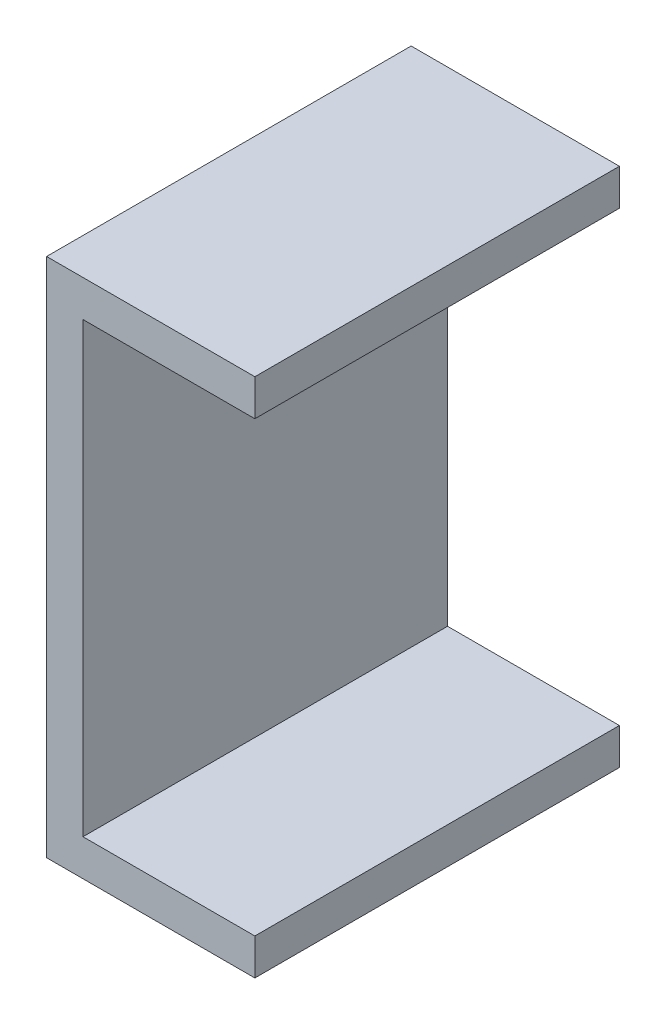
ISO-10303-21;
HEADER;
FILE_DESCRIPTION(('STEP AP214'),'2;1');
FILE_NAME('part.step','',(''),(''),'','','');
FILE_SCHEMA(('AUTOMOTIVE_DESIGN { 1 0 10303 214 1 1 1 1 }'));
ENDSEC;
DATA;
#1=APPLICATION_CONTEXT('core data for automotive mechanical design processes');
#2=APPLICATION_PROTOCOL_DEFINITION('international standard','automotive_design',2000,#1);
#3=PRODUCT_CONTEXT('',#1,'mechanical');
#4=PRODUCT('Part','Part','',(#3));
#5=PRODUCT_RELATED_PRODUCT_CATEGORY('part','',(#4));
#6=PRODUCT_DEFINITION_FORMATION('','',#4);
#7=PRODUCT_DEFINITION_CONTEXT('part definition',#1,'design');
#8=PRODUCT_DEFINITION('design','',#6,#7);
#9=PRODUCT_DEFINITION_SHAPE('','',#8);
#10=(LENGTH_UNIT() NAMED_UNIT(*) SI_UNIT(.MILLI.,.METRE.));
#11=(NAMED_UNIT(*) PLANE_ANGLE_UNIT() SI_UNIT($,.RADIAN.));
#12=(NAMED_UNIT(*) SI_UNIT($,.STERADIAN.) SOLID_ANGLE_UNIT());
#13=UNCERTAINTY_MEASURE_WITH_UNIT(LENGTH_MEASURE(1.E-05),#10,'distance_accuracy_value','');
#14=(GEOMETRIC_REPRESENTATION_CONTEXT(3) GLOBAL_UNCERTAINTY_ASSIGNED_CONTEXT((#13)) GLOBAL_UNIT_ASSIGNED_CONTEXT((#10,
#11,#12)) REPRESENTATION_CONTEXT('',''));
#15=CARTESIAN_POINT('',(0.,0.,0.));
#16=DIRECTION('',(0.,0.,1.));
#17=DIRECTION('',(1.,0.,0.));
#18=AXIS2_PLACEMENT_3D('',#15,#16,#17);
#19=CARTESIAN_POINT('',(1.99949308,-4.30050702,0.));
#20=DIRECTION('',(1.,0.,0.));
#21=DIRECTION('',(0.,0.,-1.));
#22=AXIS2_PLACEMENT_3D('',#19,#20,#21);
#23=PLANE('',#22);
#24=DIRECTION('',(0.,0.,-1.));
#25=VECTOR('',#24,1.);
#26=CARTESIAN_POINT('',(1.99949308,-4.99949216,0.));
#27=LINE('',#26,#25);
#28=CARTESIAN_POINT('',(1.99949308,-4.99949216,0.));
#29=VERTEX_POINT('',#28);
#30=CARTESIAN_POINT('',(1.99949308,-4.99949216,7.));
#31=VERTEX_POINT('',#30);
#32=EDGE_CURVE('E85',#29,#31,#27,.F.);
#33=ORIENTED_EDGE('',*,*,#32,.F.);
#34=DIRECTION('',(0.,1.,0.));
#35=VECTOR('',#34,1.);
#36=CARTESIAN_POINT('',(1.99949308,-4.30050702,0.));
#37=LINE('',#36,#35);
#38=CARTESIAN_POINT('',(1.99949308,-4.30050702,0.));
#39=VERTEX_POINT('',#38);
#40=EDGE_CURVE('E90',#29,#39,#37,.T.);
#41=ORIENTED_EDGE('',*,*,#40,.T.);
#42=DIRECTION('',(0.,0.,1.));
#43=VECTOR('',#42,1.);
#44=CARTESIAN_POINT('',(1.99949308,-4.30050702,0.));
#45=LINE('',#44,#43);
#46=CARTESIAN_POINT('',(1.99949308,-4.30050702,7.));
#47=VERTEX_POINT('',#46);
#48=EDGE_CURVE('E88',#47,#39,#45,.F.);
#49=ORIENTED_EDGE('',*,*,#48,.F.);
#50=DIRECTION('',(0.,1.,0.));
#51=VECTOR('',#50,1.);
#52=CARTESIAN_POINT('',(1.99949308,-4.30050702,7.));
#53=LINE('',#52,#51);
#54=EDGE_CURVE('E20',#47,#31,#53,.F.);
#55=ORIENTED_EDGE('',*,*,#54,.T.);
#56=EDGE_LOOP('',(#33,#41,#49,#55));
#57=FACE_BOUND('',#56,.T.);
#58=ADVANCED_FACE('F17',(#57),#23,.T.);
#59=CARTESIAN_POINT('',(1.99949308,4.99949216,0.));
#60=DIRECTION('',(1.,0.,0.));
#61=DIRECTION('',(0.,0.,-1.));
#62=AXIS2_PLACEMENT_3D('',#59,#60,#61);
#63=PLANE('',#62);
#64=DIRECTION('',(0.,0.,-1.));
#65=VECTOR('',#64,1.);
#66=CARTESIAN_POINT('',(1.99949308,4.30050702,0.));
#67=LINE('',#66,#65);
#68=CARTESIAN_POINT('',(1.99949308,4.30050702,0.));
#69=VERTEX_POINT('',#68);
#70=CARTESIAN_POINT('',(1.99949308,4.30050702,7.));
#71=VERTEX_POINT('',#70);
#72=EDGE_CURVE('E111',#69,#71,#67,.F.);
#73=ORIENTED_EDGE('',*,*,#72,.F.);
#74=DIRECTION('',(0.,1.,0.));
#75=VECTOR('',#74,1.);
#76=CARTESIAN_POINT('',(1.99949308,4.99949216,0.));
#77=LINE('',#76,#75);
#78=CARTESIAN_POINT('',(1.99949308,4.99949216,0.));
#79=VERTEX_POINT('',#78);
#80=EDGE_CURVE('E117',#69,#79,#77,.T.);
#81=ORIENTED_EDGE('',*,*,#80,.T.);
#82=DIRECTION('',(0.,0.,1.));
#83=VECTOR('',#82,1.);
#84=CARTESIAN_POINT('',(1.99949308,4.99949216,0.));
#85=LINE('',#84,#83);
#86=CARTESIAN_POINT('',(1.99949308,4.99949216,7.));
#87=VERTEX_POINT('',#86);
#88=EDGE_CURVE('E130',#87,#79,#85,.F.);
#89=ORIENTED_EDGE('',*,*,#88,.F.);
#90=DIRECTION('',(0.,1.,0.));
#91=VECTOR('',#90,1.);
#92=CARTESIAN_POINT('',(1.99949308,4.99949216,7.));
#93=LINE('',#92,#91);
#94=EDGE_CURVE('E138',#71,#87,#93,.T.);
#95=ORIENTED_EDGE('',*,*,#94,.F.);
#96=EDGE_LOOP('',(#73,#81,#89,#95));
#97=FACE_BOUND('',#96,.T.);
#98=ADVANCED_FACE('F154',(#97),#63,.T.);
#99=CARTESIAN_POINT('',(-1.3005054,-4.30050702,0.));
#100=DIRECTION('',(0.,1.,0.));
#101=DIRECTION('',(0.,0.,1.));
#102=AXIS2_PLACEMENT_3D('',#99,#100,#101);
#103=PLANE('',#102);
#104=ORIENTED_EDGE('',*,*,#48,.T.);
#105=DIRECTION('',(1.,0.,0.));
#106=VECTOR('',#105,1.);
#107=CARTESIAN_POINT('',(-1.99949054,-4.30050702,0.));
#108=LINE('',#107,#106);
#109=CARTESIAN_POINT('',(-1.3005054,-4.30050702,0.));
#110=VERTEX_POINT('',#109);
#111=EDGE_CURVE('E122',#39,#110,#108,.F.);
#112=ORIENTED_EDGE('',*,*,#111,.T.);
#113=DIRECTION('',(0.,0.,-1.));
#114=VECTOR('',#113,1.);
#115=CARTESIAN_POINT('',(-1.3005054,-4.30050702,0.));
#116=LINE('',#115,#114);
#117=CARTESIAN_POINT('',(-1.3005054,-4.30050702,7.));
#118=VERTEX_POINT('',#117);
#119=EDGE_CURVE('E113',#118,#110,#116,.T.);
#120=ORIENTED_EDGE('',*,*,#119,.F.);
#121=DIRECTION('',(1.,0.,0.));
#122=VECTOR('',#121,1.);
#123=CARTESIAN_POINT('',(-1.99949054,-4.30050702,7.));
#124=LINE('',#123,#122);
#125=EDGE_CURVE('E103',#47,#118,#124,.F.);
#126=ORIENTED_EDGE('',*,*,#125,.F.);
#127=EDGE_LOOP('',(#104,#112,#120,#126));
#128=FACE_BOUND('',#127,.T.);
#129=ADVANCED_FACE('F121',(#128),#103,.T.);
#130=CARTESIAN_POINT('',(-1.3005054,4.30050702,0.));
#131=DIRECTION('',(1.,0.,0.));
#132=DIRECTION('',(0.,0.,-1.));
#133=AXIS2_PLACEMENT_3D('',#130,#131,#132);
#134=PLANE('',#133);
#135=ORIENTED_EDGE('',*,*,#119,.T.);
#136=DIRECTION('',(0.,1.,0.));
#137=VECTOR('',#136,1.);
#138=CARTESIAN_POINT('',(-1.3005054,4.99949216,0.));
#139=LINE('',#138,#137);
#140=CARTESIAN_POINT('',(-1.3005054,4.30050702,0.));
#141=VERTEX_POINT('',#140);
#142=EDGE_CURVE('E126',#110,#141,#139,.T.);
#143=ORIENTED_EDGE('',*,*,#142,.T.);
#144=DIRECTION('',(0.,0.,-1.));
#145=VECTOR('',#144,1.);
#146=CARTESIAN_POINT('',(-1.3005054,4.30050702,0.));
#147=LINE('',#146,#145);
#148=CARTESIAN_POINT('',(-1.3005054,4.30050702,7.));
#149=VERTEX_POINT('',#148);
#150=EDGE_CURVE('E97',#149,#141,#147,.T.);
#151=ORIENTED_EDGE('',*,*,#150,.F.);
#152=DIRECTION('',(0.,1.,0.));
#153=VECTOR('',#152,1.);
#154=CARTESIAN_POINT('',(-1.3005054,4.99949216,7.));
#155=LINE('',#154,#153);
#156=EDGE_CURVE('E105',#118,#149,#155,.T.);
#157=ORIENTED_EDGE('',*,*,#156,.F.);
#158=EDGE_LOOP('',(#135,#143,#151,#157));
#159=FACE_BOUND('',#158,.T.);
#160=ADVANCED_FACE('F146',(#159),#134,.T.);
#161=CARTESIAN_POINT('',(1.99949308,4.30050702,0.));
#162=DIRECTION('',(0.,-1.,0.));
#163=DIRECTION('',(0.,0.,-1.));
#164=AXIS2_PLACEMENT_3D('',#161,#162,#163);
#165=PLANE('',#164);
#166=ORIENTED_EDGE('',*,*,#150,.T.);
#167=DIRECTION('',(1.,0.,0.));
#168=VECTOR('',#167,1.);
#169=CARTESIAN_POINT('',(-1.99949054,4.30050702,0.));
#170=LINE('',#169,#168);
#171=EDGE_CURVE('E128',#141,#69,#170,.T.);
#172=ORIENTED_EDGE('',*,*,#171,.T.);
#173=ORIENTED_EDGE('',*,*,#72,.T.);
#174=DIRECTION('',(1.,0.,0.));
#175=VECTOR('',#174,1.);
#176=CARTESIAN_POINT('',(-1.99949054,4.30050702,7.));
#177=LINE('',#176,#175);
#178=EDGE_CURVE('E140',#149,#71,#177,.T.);
#179=ORIENTED_EDGE('',*,*,#178,.F.);
#180=EDGE_LOOP('',(#166,#172,#173,#179));
#181=FACE_BOUND('',#180,.T.);
#182=ADVANCED_FACE('F149',(#181),#165,.T.);
#183=CARTESIAN_POINT('',(1.99949308,-4.99949216,0.));
#184=DIRECTION('',(0.,-1.,0.));
#185=DIRECTION('',(0.,0.,-1.));
#186=AXIS2_PLACEMENT_3D('',#183,#184,#185);
#187=PLANE('',#186);
#188=DIRECTION('',(0.,0.,1.));
#189=VECTOR('',#188,1.);
#190=CARTESIAN_POINT('',(-1.99949054,-4.99949216,0.));
#191=LINE('',#190,#189);
#192=CARTESIAN_POINT('',(-1.99949054,-4.99949216,0.));
#193=VERTEX_POINT('',#192);
#194=CARTESIAN_POINT('',(-1.99949054,-4.99949216,7.));
#195=VERTEX_POINT('',#194);
#196=EDGE_CURVE('E160',#193,#195,#191,.T.);
#197=ORIENTED_EDGE('',*,*,#196,.F.);
#198=DIRECTION('',(1.,0.,0.));
#199=VECTOR('',#198,1.);
#200=CARTESIAN_POINT('',(-1.99949054,-4.99949216,0.));
#201=LINE('',#200,#199);
#202=EDGE_CURVE('E96',#193,#29,#201,.T.);
#203=ORIENTED_EDGE('',*,*,#202,.T.);
#204=ORIENTED_EDGE('',*,*,#32,.T.);
#205=DIRECTION('',(1.,0.,0.));
#206=VECTOR('',#205,1.);
#207=CARTESIAN_POINT('',(-1.99949054,-4.99949216,7.));
#208=LINE('',#207,#206);
#209=EDGE_CURVE('E93',#195,#31,#208,.T.);
#210=ORIENTED_EDGE('',*,*,#209,.F.);
#211=EDGE_LOOP('',(#197,#203,#204,#210));
#212=FACE_BOUND('',#211,.T.);
#213=ADVANCED_FACE('F92',(#212),#187,.T.);
#214=CARTESIAN_POINT('',(-1.99949054,4.99949216,7.));
#215=DIRECTION('',(0.,0.,1.));
#216=DIRECTION('',(1.,0.,0.));
#217=AXIS2_PLACEMENT_3D('',#214,#215,#216);
#218=PLANE('',#217);
#219=ORIENTED_EDGE('',*,*,#94,.T.);
#220=DIRECTION('',(1.,0.,0.));
#221=VECTOR('',#220,1.);
#222=CARTESIAN_POINT('',(-1.99949054,4.99949216,7.));
#223=LINE('',#222,#221);
#224=CARTESIAN_POINT('',(-1.99949054,4.99949216,7.));
#225=VERTEX_POINT('',#224);
#226=EDGE_CURVE('E135',#225,#87,#223,.T.);
#227=ORIENTED_EDGE('',*,*,#226,.F.);
#228=DIRECTION('',(0.,1.,0.));
#229=VECTOR('',#228,1.);
#230=CARTESIAN_POINT('',(-1.99949054,-4.99949216,7.));
#231=LINE('',#230,#229);
#232=EDGE_CURVE('E101',#195,#225,#231,.T.);
#233=ORIENTED_EDGE('',*,*,#232,.F.);
#234=ORIENTED_EDGE('',*,*,#209,.T.);
#235=ORIENTED_EDGE('',*,*,#54,.F.);
#236=ORIENTED_EDGE('',*,*,#125,.T.);
#237=ORIENTED_EDGE('',*,*,#156,.T.);
#238=ORIENTED_EDGE('',*,*,#178,.T.);
#239=EDGE_LOOP('',(#219,#227,#233,#234,#235,#236,#237,#238));
#240=FACE_BOUND('',#239,.T.);
#241=ADVANCED_FACE('F99',(#240),#218,.T.);
#242=CARTESIAN_POINT('',(-1.99949054,4.99949216,0.));
#243=DIRECTION('',(0.,1.,0.));
#244=DIRECTION('',(0.,0.,1.));
#245=AXIS2_PLACEMENT_3D('',#242,#243,#244);
#246=PLANE('',#245);
#247=ORIENTED_EDGE('',*,*,#88,.T.);
#248=DIRECTION('',(1.,0.,0.));
#249=VECTOR('',#248,1.);
#250=CARTESIAN_POINT('',(-1.99949054,4.99949216,0.));
#251=LINE('',#250,#249);
#252=CARTESIAN_POINT('',(-1.99949054,4.99949216,0.));
#253=VERTEX_POINT('',#252);
#254=EDGE_CURVE('E35',#79,#253,#251,.F.);
#255=ORIENTED_EDGE('',*,*,#254,.T.);
#256=DIRECTION('',(0.,0.,1.));
#257=VECTOR('',#256,1.);
#258=CARTESIAN_POINT('',(-1.99949054,4.99949216,0.));
#259=LINE('',#258,#257);
#260=EDGE_CURVE('E26',#225,#253,#259,.F.);
#261=ORIENTED_EDGE('',*,*,#260,.F.);
#262=ORIENTED_EDGE('',*,*,#226,.T.);
#263=EDGE_LOOP('',(#247,#255,#261,#262));
#264=FACE_BOUND('',#263,.T.);
#265=ADVANCED_FACE('F156',(#264),#246,.T.);
#266=CARTESIAN_POINT('',(-1.99949054,4.99949216,0.));
#267=DIRECTION('',(0.,0.,1.));
#268=DIRECTION('',(1.,0.,0.));
#269=AXIS2_PLACEMENT_3D('',#266,#267,#268);
#270=PLANE('',#269);
#271=ORIENTED_EDGE('',*,*,#80,.F.);
#272=ORIENTED_EDGE('',*,*,#171,.F.);
#273=ORIENTED_EDGE('',*,*,#142,.F.);
#274=ORIENTED_EDGE('',*,*,#111,.F.);
#275=ORIENTED_EDGE('',*,*,#40,.F.);
#276=ORIENTED_EDGE('',*,*,#202,.F.);
#277=DIRECTION('',(0.,1.,0.));
#278=VECTOR('',#277,1.);
#279=CARTESIAN_POINT('',(-1.99949054,-4.99949216,0.));
#280=LINE('',#279,#278);
#281=EDGE_CURVE('E11',#253,#193,#280,.F.);
#282=ORIENTED_EDGE('',*,*,#281,.F.);
#283=ORIENTED_EDGE('',*,*,#254,.F.);
#284=EDGE_LOOP('',(#271,#272,#273,#274,#275,#276,#282,#283));
#285=FACE_BOUND('',#284,.T.);
#286=ADVANCED_FACE('F124',(#285),#270,.F.);
#287=CARTESIAN_POINT('',(-1.99949054,-4.99949216,0.));
#288=DIRECTION('',(-1.,0.,0.));
#289=DIRECTION('',(0.,0.,1.));
#290=AXIS2_PLACEMENT_3D('',#287,#288,#289);
#291=PLANE('',#290);
#292=ORIENTED_EDGE('',*,*,#260,.T.);
#293=ORIENTED_EDGE('',*,*,#281,.T.);
#294=ORIENTED_EDGE('',*,*,#196,.T.);
#295=ORIENTED_EDGE('',*,*,#232,.T.);
#296=EDGE_LOOP('',(#292,#293,#294,#295));
#297=FACE_BOUND('',#296,.T.);
#298=ADVANCED_FACE('F159',(#297),#291,.T.);
#299=CLOSED_SHELL('',(#58,#98,#129,#160,#182,#213,#241,#265,#286,#298));
#300=MANIFOLD_SOLID_BREP('B1',#299);
#301=ADVANCED_BREP_SHAPE_REPRESENTATION('',(#18,#300),#14);
#302=SHAPE_DEFINITION_REPRESENTATION(#9,#301);
ENDSEC;
END-ISO-10303-21;
